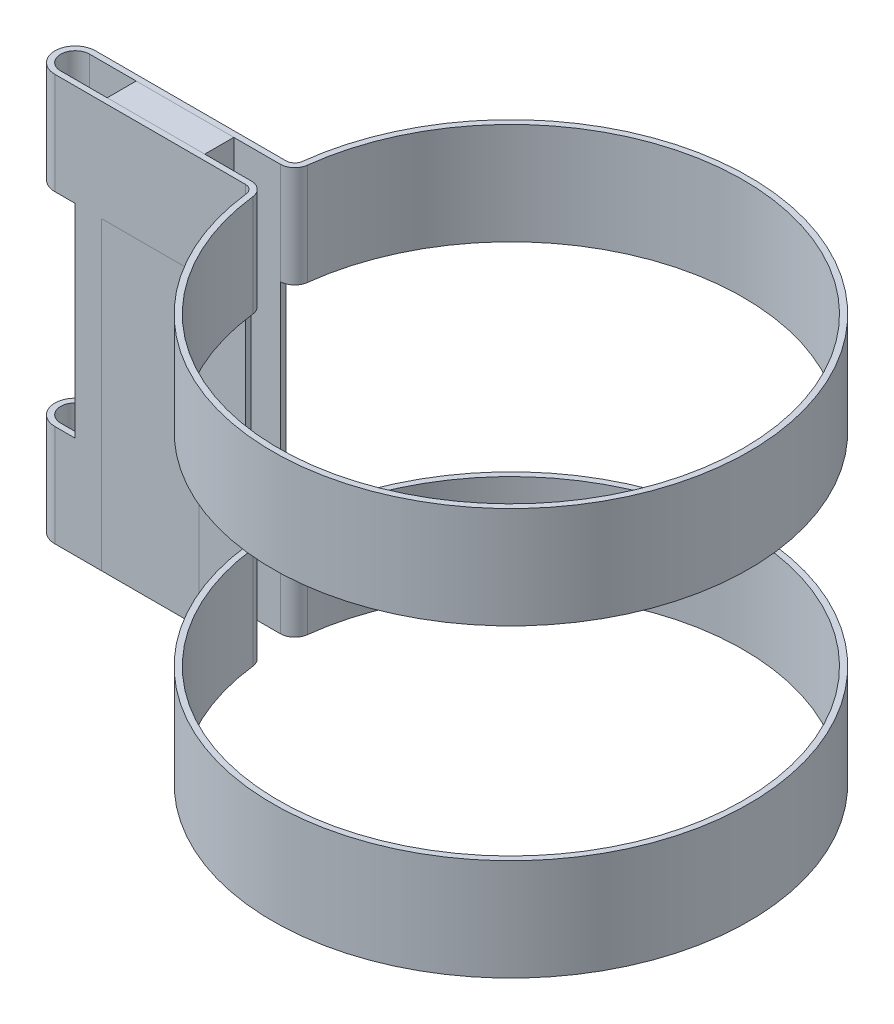
ISO-10303-21;
HEADER;
FILE_DESCRIPTION(('STEP AP214'),'2;1');
FILE_NAME('part.step','',(''),(''),'','','');
FILE_SCHEMA(('AUTOMOTIVE_DESIGN { 1 0 10303 214 1 1 1 1 }'));
ENDSEC;
DATA;
#1=APPLICATION_CONTEXT('core data for automotive mechanical design processes');
#2=APPLICATION_PROTOCOL_DEFINITION('international standard','automotive_design',2000,#1);
#3=PRODUCT_CONTEXT('',#1,'mechanical');
#4=PRODUCT('Part','Part','',(#3));
#5=PRODUCT_RELATED_PRODUCT_CATEGORY('part','',(#4));
#6=PRODUCT_DEFINITION_FORMATION('','',#4);
#7=PRODUCT_DEFINITION_CONTEXT('part definition',#1,'design');
#8=PRODUCT_DEFINITION('design','',#6,#7);
#9=PRODUCT_DEFINITION_SHAPE('','',#8);
#10=(LENGTH_UNIT() NAMED_UNIT(*) SI_UNIT(.MILLI.,.METRE.));
#11=(NAMED_UNIT(*) PLANE_ANGLE_UNIT() SI_UNIT($,.RADIAN.));
#12=(NAMED_UNIT(*) SI_UNIT($,.STERADIAN.) SOLID_ANGLE_UNIT());
#13=UNCERTAINTY_MEASURE_WITH_UNIT(LENGTH_MEASURE(1.E-05),#10,'distance_accuracy_value','');
#14=(GEOMETRIC_REPRESENTATION_CONTEXT(3) GLOBAL_UNCERTAINTY_ASSIGNED_CONTEXT((#13)) GLOBAL_UNIT_ASSIGNED_CONTEXT((#10,
#11,#12)) REPRESENTATION_CONTEXT('',''));
#15=CARTESIAN_POINT('',(0.,0.,0.));
#16=DIRECTION('',(0.,0.,1.));
#17=DIRECTION('',(1.,0.,0.));
#18=AXIS2_PLACEMENT_3D('',#15,#16,#17);
#19=CARTESIAN_POINT('',(-67.,0.,-3.49999999999998));
#20=DIRECTION('',(-1.,0.,0.));
#21=DIRECTION('',(0.,0.,1.));
#22=AXIS2_PLACEMENT_3D('',#19,#20,#21);
#23=PLANE('',#22);
#24=DIRECTION('',(0.,0.,1.));
#25=VECTOR('',#24,1.);
#26=CARTESIAN_POINT('',(-67.,70.,-3.49999999999998));
#27=LINE('',#26,#25);
#28=CARTESIAN_POINT('',(-67.,70.,-3.49999999999998));
#29=VERTEX_POINT('',#28);
#30=CARTESIAN_POINT('',(-67.,70.,3.5));
#31=VERTEX_POINT('',#30);
#32=EDGE_CURVE('E115',#29,#31,#27,.T.);
#33=ORIENTED_EDGE('',*,*,#32,.F.);
#34=DIRECTION('',(0.,1.,0.));
#35=VECTOR('',#34,1.);
#36=CARTESIAN_POINT('',(-67.,0.,-3.49999999999998));
#37=LINE('',#36,#35);
#38=CARTESIAN_POINT('',(-67.,0.,-3.49999999999998));
#39=VERTEX_POINT('',#38);
#40=EDGE_CURVE('E12',#39,#29,#37,.T.);
#41=ORIENTED_EDGE('',*,*,#40,.F.);
#42=DIRECTION('',(0.,0.,1.));
#43=VECTOR('',#42,1.);
#44=CARTESIAN_POINT('',(-67.,0.,-3.49999999999998));
#45=LINE('',#44,#43);
#46=CARTESIAN_POINT('',(-67.,0.,3.5));
#47=VERTEX_POINT('',#46);
#48=EDGE_CURVE('E109',#39,#47,#45,.T.);
#49=ORIENTED_EDGE('',*,*,#48,.T.);
#50=DIRECTION('',(0.,1.,0.));
#51=VECTOR('',#50,1.);
#52=CARTESIAN_POINT('',(-67.,0.,3.5));
#53=LINE('',#52,#51);
#54=EDGE_CURVE('E54',#47,#31,#53,.T.);
#55=ORIENTED_EDGE('',*,*,#54,.T.);
#56=EDGE_LOOP('',(#33,#41,#49,#55));
#57=FACE_BOUND('',#56,.T.);
#58=ADVANCED_FACE('F51',(#57),#23,.T.);
#59=CARTESIAN_POINT('',(-67.,0.,-3.49999999999998));
#60=DIRECTION('',(0.,0.,-1.));
#61=DIRECTION('',(-1.,0.,0.));
#62=AXIS2_PLACEMENT_3D('',#59,#60,#61);
#63=PLANE('',#62);
#64=DIRECTION('',(-1.,0.,0.));
#65=VECTOR('',#64,1.);
#66=CARTESIAN_POINT('',(-67.,70.,-3.49999999999998));
#67=LINE('',#66,#65);
#68=CARTESIAN_POINT('',(-50.2048575403353,70.,-3.49999999999998));
#69=VERTEX_POINT('',#68);
#70=EDGE_CURVE('E111',#69,#29,#67,.T.);
#71=ORIENTED_EDGE('',*,*,#70,.F.);
#72=DIRECTION('',(0.,1.,0.));
#73=VECTOR('',#72,1.);
#74=CARTESIAN_POINT('',(-50.2048575403353,0.,-3.49999999999998));
#75=LINE('',#74,#73);
#76=CARTESIAN_POINT('',(-50.2048575403353,0.,-3.49999999999998));
#77=VERTEX_POINT('',#76);
#78=EDGE_CURVE('E60',#77,#69,#75,.T.);
#79=ORIENTED_EDGE('',*,*,#78,.F.);
#80=DIRECTION('',(-1.,0.,0.));
#81=VECTOR('',#80,1.);
#82=CARTESIAN_POINT('',(-67.,0.,-3.49999999999998));
#83=LINE('',#82,#81);
#84=EDGE_CURVE('E106',#77,#39,#83,.T.);
#85=ORIENTED_EDGE('',*,*,#84,.T.);
#86=ORIENTED_EDGE('',*,*,#40,.T.);
#87=EDGE_LOOP('',(#71,#79,#85,#86));
#88=FACE_BOUND('',#87,.T.);
#89=ADVANCED_FACE('F125',(#88),#63,.T.);
#90=CARTESIAN_POINT('',(-50.2048575403353,0.,-3.49999999999998));
#91=DIRECTION('',(1.,0.,0.));
#92=DIRECTION('',(0.,0.,-1.));
#93=AXIS2_PLACEMENT_3D('',#90,#91,#92);
#94=PLANE('',#93);
#95=DIRECTION('',(0.,0.,-1.));
#96=VECTOR('',#95,1.);
#97=CARTESIAN_POINT('',(-50.2048575403353,70.,-3.49999999999998));
#98=LINE('',#97,#96);
#99=CARTESIAN_POINT('',(-50.2048575403353,70.,3.5));
#100=VERTEX_POINT('',#99);
#101=EDGE_CURVE('E101',#100,#69,#98,.T.);
#102=ORIENTED_EDGE('',*,*,#101,.F.);
#103=DIRECTION('',(0.,1.,0.));
#104=VECTOR('',#103,1.);
#105=CARTESIAN_POINT('',(-50.2048575403353,0.,3.5));
#106=LINE('',#105,#104);
#107=CARTESIAN_POINT('',(-50.2048575403353,0.,3.5));
#108=VERTEX_POINT('',#107);
#109=EDGE_CURVE('E96',#108,#100,#106,.T.);
#110=ORIENTED_EDGE('',*,*,#109,.F.);
#111=DIRECTION('',(0.,0.,-1.));
#112=VECTOR('',#111,1.);
#113=CARTESIAN_POINT('',(-50.2048575403353,0.,-3.49999999999998));
#114=LINE('',#113,#112);
#115=EDGE_CURVE('E99',#108,#77,#114,.T.);
#116=ORIENTED_EDGE('',*,*,#115,.T.);
#117=ORIENTED_EDGE('',*,*,#78,.T.);
#118=EDGE_LOOP('',(#102,#110,#116,#117));
#119=FACE_BOUND('',#118,.T.);
#120=ADVANCED_FACE('F98',(#119),#94,.T.);
#121=CARTESIAN_POINT('',(-67.,0.,3.5));
#122=DIRECTION('',(0.,0.,1.));
#123=DIRECTION('',(1.,0.,0.));
#124=AXIS2_PLACEMENT_3D('',#121,#122,#123);
#125=PLANE('',#124);
#126=DIRECTION('',(1.,0.,0.));
#127=VECTOR('',#126,1.);
#128=CARTESIAN_POINT('',(-67.,70.,3.5));
#129=LINE('',#128,#127);
#130=EDGE_CURVE('E118',#31,#100,#129,.T.);
#131=ORIENTED_EDGE('',*,*,#130,.F.);
#132=ORIENTED_EDGE('',*,*,#54,.F.);
#133=DIRECTION('',(1.,0.,0.));
#134=VECTOR('',#133,1.);
#135=CARTESIAN_POINT('',(-67.,0.,3.5));
#136=LINE('',#135,#134);
#137=EDGE_CURVE('E105',#47,#108,#136,.T.);
#138=ORIENTED_EDGE('',*,*,#137,.T.);
#139=ORIENTED_EDGE('',*,*,#109,.T.);
#140=EDGE_LOOP('',(#131,#132,#138,#139));
#141=FACE_BOUND('',#140,.T.);
#142=ADVANCED_FACE('F108',(#141),#125,.T.);
#143=CARTESIAN_POINT('',(0.,0.,0.));
#144=DIRECTION('',(0.,1.,0.));
#145=DIRECTION('',(0.,0.,1.));
#146=AXIS2_PLACEMENT_3D('',#143,#144,#145);
#147=PLANE('',#146);
#148=ORIENTED_EDGE('',*,*,#48,.F.);
#149=ORIENTED_EDGE('',*,*,#84,.F.);
#150=ORIENTED_EDGE('',*,*,#115,.F.);
#151=ORIENTED_EDGE('',*,*,#137,.F.);
#152=EDGE_LOOP('',(#148,#149,#150,#151));
#153=FACE_BOUND('',#152,.T.);
#154=ADVANCED_FACE('F104',(#153),#147,.F.);
#155=CARTESIAN_POINT('',(0.,70.,0.));
#156=DIRECTION('',(0.,1.,0.));
#157=DIRECTION('',(0.,0.,1.));
#158=AXIS2_PLACEMENT_3D('',#155,#156,#157);
#159=PLANE('',#158);
#160=ORIENTED_EDGE('',*,*,#32,.T.);
#161=ORIENTED_EDGE('',*,*,#130,.T.);
#162=ORIENTED_EDGE('',*,*,#101,.T.);
#163=ORIENTED_EDGE('',*,*,#70,.T.);
#164=EDGE_LOOP('',(#160,#161,#162,#163));
#165=FACE_BOUND('',#164,.T.);
#166=ADVANCED_FACE('F124',(#165),#159,.T.);
#167=CLOSED_SHELL('',(#58,#89,#120,#142,#154,#166));
#168=MANIFOLD_SOLID_BREP('B2',#167);
#169=CARTESIAN_POINT('',(-42.2048575403353,70.,4.99999999999998));
#170=DIRECTION('',(0.,-1.,0.));
#171=DIRECTION('',(0.,0.,-1.));
#172=AXIS2_PLACEMENT_3D('',#169,#170,#171);
#173=CYLINDRICAL_SURFACE('',#172,1.5);
#174=DIRECTION('',(0.,-1.,0.));
#175=VECTOR('',#174,1.);
#176=CARTESIAN_POINT('',(-40.7152743330294,70.,4.82352941176466));
#177=LINE('',#176,#175);
#178=CARTESIAN_POINT('',(-40.7152743330294,17.5,4.82352941176466));
#179=VERTEX_POINT('',#178);
#180=CARTESIAN_POINT('',(-40.7152743330294,0.,4.82352941176466));
#181=VERTEX_POINT('',#180);
#182=EDGE_CURVE('E446',#179,#181,#177,.T.);
#183=ORIENTED_EDGE('',*,*,#182,.F.);
#184=CARTESIAN_POINT('',(-42.2048575403353,17.5,4.99999999999998));
#185=DIRECTION('',(0.,-1.,0.));
#186=DIRECTION('',(1.,0.,0.));
#187=AXIS2_PLACEMENT_3D('',#184,#185,#186);
#188=CIRCLE('',#187,1.5);
#189=CARTESIAN_POINT('',(-42.2048575403353,17.5,3.49999999999998));
#190=VERTEX_POINT('',#189);
#191=EDGE_CURVE('E556',#179,#190,#188,.F.);
#192=ORIENTED_EDGE('',*,*,#191,.T.);
#193=DIRECTION('',(0.,-1.,0.));
#194=VECTOR('',#193,1.);
#195=CARTESIAN_POINT('',(-42.2048575403353,70.,3.49999999999998));
#196=LINE('',#195,#194);
#197=CARTESIAN_POINT('',(-42.2048575403353,0.,3.49999999999998));
#198=VERTEX_POINT('',#197);
#199=EDGE_CURVE('E450',#190,#198,#196,.T.);
#200=ORIENTED_EDGE('',*,*,#199,.T.);
#201=CARTESIAN_POINT('',(-42.2048575403353,0.,4.99999999999998));
#202=DIRECTION('',(0.,-1.,0.));
#203=DIRECTION('',(0.,0.,1.));
#204=AXIS2_PLACEMENT_3D('',#201,#202,#203);
#205=CIRCLE('',#204,1.5);
#206=EDGE_CURVE('E424',#198,#181,#205,.T.);
#207=ORIENTED_EDGE('',*,*,#206,.T.);
#208=EDGE_LOOP('',(#183,#192,#200,#207));
#209=FACE_BOUND('',#208,.T.);
#210=ADVANCED_FACE('F175',(#209),#173,.F.);
#211=CARTESIAN_POINT('',(0.,70.,0.));
#212=DIRECTION('',(0.,-1.,0.));
#213=DIRECTION('',(0.,0.,-1.));
#214=AXIS2_PLACEMENT_3D('',#211,#212,#213);
#215=CYLINDRICAL_SURFACE('',#214,41.);
#216=CARTESIAN_POINT('',(0.,52.5,0.));
#217=DIRECTION('',(0.,1.,0.));
#218=DIRECTION('',(0.,0.,1.));
#219=AXIS2_PLACEMENT_3D('',#216,#217,#218);
#220=CIRCLE('',#219,41.);
#221=CARTESIAN_POINT('',(-40.7152743330294,52.5,4.82352941176466));
#222=VERTEX_POINT('',#221);
#223=CARTESIAN_POINT('',(-40.7152743330294,52.5,-4.82352941176471));
#224=VERTEX_POINT('',#223);
#225=EDGE_CURVE('E548',#222,#224,#220,.T.);
#226=ORIENTED_EDGE('',*,*,#225,.T.);
#227=DIRECTION('',(0.,-1.,0.));
#228=VECTOR('',#227,1.);
#229=CARTESIAN_POINT('',(-40.7152743330294,70.,-4.82352941176471));
#230=LINE('',#229,#228);
#231=CARTESIAN_POINT('',(-40.7152743330294,70.,-4.82352941176471));
#232=VERTEX_POINT('',#231);
#233=EDGE_CURVE('E443',#232,#224,#230,.T.);
#234=ORIENTED_EDGE('',*,*,#233,.F.);
#235=CARTESIAN_POINT('',(0.,70.,0.));
#236=DIRECTION('',(0.,1.,0.));
#237=DIRECTION('',(0.,0.,1.));
#238=AXIS2_PLACEMENT_3D('',#235,#236,#237);
#239=CIRCLE('',#238,41.);
#240=CARTESIAN_POINT('',(-40.7152743330294,70.,4.82352941176466));
#241=VERTEX_POINT('',#240);
#242=EDGE_CURVE('E412',#241,#232,#239,.T.);
#243=ORIENTED_EDGE('',*,*,#242,.F.);
#244=EDGE_CURVE('E447',#241,#222,#177,.T.);
#245=ORIENTED_EDGE('',*,*,#244,.T.);
#246=EDGE_LOOP('',(#226,#234,#243,#245));
#247=FACE_BOUND('',#246,.T.);
#248=ADVANCED_FACE('F622',(#247),#215,.T.);
#249=CARTESIAN_POINT('',(-42.2048575403353,70.,-5.));
#250=DIRECTION('',(0.,-1.,0.));
#251=DIRECTION('',(0.,0.,-1.));
#252=AXIS2_PLACEMENT_3D('',#249,#250,#251);
#253=CYLINDRICAL_SURFACE('',#252,1.50000000000001);
#254=DIRECTION('',(0.,-1.,0.));
#255=VECTOR('',#254,1.);
#256=CARTESIAN_POINT('',(-42.2048575403353,70.,-3.49999999999998));
#257=LINE('',#256,#255);
#258=CARTESIAN_POINT('',(-42.2048575403353,17.5,-3.49999999999998));
#259=VERTEX_POINT('',#258);
#260=CARTESIAN_POINT('',(-42.2048575403353,0.,-3.49999999999998));
#261=VERTEX_POINT('',#260);
#262=EDGE_CURVE('E438',#259,#261,#257,.T.);
#263=ORIENTED_EDGE('',*,*,#262,.F.);
#264=CARTESIAN_POINT('',(-42.2048575403353,17.5,-5.));
#265=DIRECTION('',(0.,-1.,0.));
#266=DIRECTION('',(1.,0.,0.));
#267=AXIS2_PLACEMENT_3D('',#264,#265,#266);
#268=CIRCLE('',#267,1.50000000000001);
#269=CARTESIAN_POINT('',(-40.7152743330294,17.5,-4.82352941176471));
#270=VERTEX_POINT('',#269);
#271=EDGE_CURVE('E373',#259,#270,#268,.F.);
#272=ORIENTED_EDGE('',*,*,#271,.T.);
#273=CARTESIAN_POINT('',(-40.7152743330294,0.,-4.82352941176471));
#274=VERTEX_POINT('',#273);
#275=EDGE_CURVE('E442',#270,#274,#230,.T.);
#276=ORIENTED_EDGE('',*,*,#275,.T.);
#277=CARTESIAN_POINT('',(-42.2048575403353,0.,-5.));
#278=DIRECTION('',(0.,-1.,0.));
#279=DIRECTION('',(0.,0.,1.));
#280=AXIS2_PLACEMENT_3D('',#277,#278,#279);
#281=CIRCLE('',#280,1.50000000000001);
#282=EDGE_CURVE('E430',#274,#261,#281,.T.);
#283=ORIENTED_EDGE('',*,*,#282,.T.);
#284=EDGE_LOOP('',(#263,#272,#276,#283));
#285=FACE_BOUND('',#284,.T.);
#286=ADVANCED_FACE('F656',(#285),#253,.F.);
#287=CARTESIAN_POINT('',(-42.2048575403353,70.,4.99999999999998));
#288=DIRECTION('',(0.,-1.,0.));
#289=DIRECTION('',(0.,0.,-1.));
#290=AXIS2_PLACEMENT_3D('',#287,#288,#289);
#291=CYLINDRICAL_SURFACE('',#290,2.49999999999999);
#292=CARTESIAN_POINT('',(-42.2048575403353,17.5,4.99999999999998));
#293=DIRECTION('',(0.,-1.,0.));
#294=DIRECTION('',(1.,0.,0.));
#295=AXIS2_PLACEMENT_3D('',#292,#293,#294);
#296=CIRCLE('',#295,2.49999999999999);
#297=CARTESIAN_POINT('',(-39.7222188614921,17.5,4.70588235294116));
#298=VERTEX_POINT('',#297);
#299=CARTESIAN_POINT('',(-42.2048575403353,17.5,2.5));
#300=VERTEX_POINT('',#299);
#301=EDGE_CURVE('E543',#298,#300,#296,.F.);
#302=ORIENTED_EDGE('',*,*,#301,.F.);
#303=DIRECTION('',(0.,-1.,0.));
#304=VECTOR('',#303,1.);
#305=CARTESIAN_POINT('',(-39.7222188614921,70.,4.70588235294116));
#306=LINE('',#305,#304);
#307=CARTESIAN_POINT('',(-39.7222188614921,0.,4.70588235294116));
#308=VERTEX_POINT('',#307);
#309=EDGE_CURVE('E399',#298,#308,#306,.T.);
#310=ORIENTED_EDGE('',*,*,#309,.T.);
#311=CARTESIAN_POINT('',(-42.2048575403353,0.,4.99999999999998));
#312=DIRECTION('',(0.,-1.,0.));
#313=DIRECTION('',(0.,0.,1.));
#314=AXIS2_PLACEMENT_3D('',#311,#312,#313);
#315=CIRCLE('',#314,2.49999999999999);
#316=CARTESIAN_POINT('',(-42.2048575403353,0.,2.5));
#317=VERTEX_POINT('',#316);
#318=EDGE_CURVE('E498',#317,#308,#315,.T.);
#319=ORIENTED_EDGE('',*,*,#318,.F.);
#320=DIRECTION('',(0.,-1.,0.));
#321=VECTOR('',#320,1.);
#322=CARTESIAN_POINT('',(-42.2048575403353,70.,2.5));
#323=LINE('',#322,#321);
#324=EDGE_CURVE('E497',#300,#317,#323,.T.);
#325=ORIENTED_EDGE('',*,*,#324,.F.);
#326=EDGE_LOOP('',(#302,#310,#319,#325));
#327=FACE_BOUND('',#326,.T.);
#328=ADVANCED_FACE('F779',(#327),#291,.T.);
#329=CARTESIAN_POINT('',(0.,70.,0.));
#330=DIRECTION('',(0.,-1.,0.));
#331=DIRECTION('',(0.,0.,-1.));
#332=AXIS2_PLACEMENT_3D('',#329,#330,#331);
#333=CYLINDRICAL_SURFACE('',#332,40.);
#334=CARTESIAN_POINT('',(0.,17.5,0.));
#335=DIRECTION('',(0.,-1.,0.));
#336=DIRECTION('',(1.,0.,0.));
#337=AXIS2_PLACEMENT_3D('',#334,#335,#336);
#338=CIRCLE('',#337,40.);
#339=CARTESIAN_POINT('',(-39.7222188614921,17.5,-4.70588235294118));
#340=VERTEX_POINT('',#339);
#341=EDGE_CURVE('E541',#340,#298,#338,.T.);
#342=ORIENTED_EDGE('',*,*,#341,.F.);
#343=DIRECTION('',(0.,-1.,0.));
#344=VECTOR('',#343,1.);
#345=CARTESIAN_POINT('',(-39.7222188614921,70.,-4.70588235294118));
#346=LINE('',#345,#344);
#347=CARTESIAN_POINT('',(-39.7222188614921,0.,-4.70588235294118));
#348=VERTEX_POINT('',#347);
#349=EDGE_CURVE('E382',#340,#348,#346,.T.);
#350=ORIENTED_EDGE('',*,*,#349,.T.);
#351=CARTESIAN_POINT('',(0.,0.,0.));
#352=DIRECTION('',(0.,1.,0.));
#353=DIRECTION('',(0.,0.,1.));
#354=AXIS2_PLACEMENT_3D('',#351,#352,#353);
#355=CIRCLE('',#354,40.);
#356=EDGE_CURVE('E501',#308,#348,#355,.T.);
#357=ORIENTED_EDGE('',*,*,#356,.F.);
#358=ORIENTED_EDGE('',*,*,#309,.F.);
#359=EDGE_LOOP('',(#342,#350,#357,#358));
#360=FACE_BOUND('',#359,.T.);
#361=ADVANCED_FACE('F540',(#360),#333,.F.);
#362=CARTESIAN_POINT('',(-42.2048575403353,70.,-5.));
#363=DIRECTION('',(0.,-1.,0.));
#364=DIRECTION('',(0.,0.,-1.));
#365=AXIS2_PLACEMENT_3D('',#362,#363,#364);
#366=CYLINDRICAL_SURFACE('',#365,2.5);
#367=CARTESIAN_POINT('',(-42.2048575403353,17.5,-5.));
#368=DIRECTION('',(0.,-1.,0.));
#369=DIRECTION('',(1.,0.,0.));
#370=AXIS2_PLACEMENT_3D('',#367,#368,#369);
#371=CIRCLE('',#370,2.5);
#372=CARTESIAN_POINT('',(-42.2048575403353,17.5,-2.5));
#373=VERTEX_POINT('',#372);
#374=EDGE_CURVE('E49',#373,#340,#371,.F.);
#375=ORIENTED_EDGE('',*,*,#374,.F.);
#376=DIRECTION('',(0.,-1.,0.));
#377=VECTOR('',#376,1.);
#378=CARTESIAN_POINT('',(-42.2048575403353,70.,-2.5));
#379=LINE('',#378,#377);
#380=CARTESIAN_POINT('',(-42.2048575403353,0.,-2.5));
#381=VERTEX_POINT('',#380);
#382=EDGE_CURVE('E380',#373,#381,#379,.T.);
#383=ORIENTED_EDGE('',*,*,#382,.T.);
#384=CARTESIAN_POINT('',(-42.2048575403353,0.,-5.));
#385=DIRECTION('',(0.,-1.,0.));
#386=DIRECTION('',(0.,0.,1.));
#387=AXIS2_PLACEMENT_3D('',#384,#385,#386);
#388=CIRCLE('',#387,2.5);
#389=EDGE_CURVE('E505',#348,#381,#388,.T.);
#390=ORIENTED_EDGE('',*,*,#389,.F.);
#391=ORIENTED_EDGE('',*,*,#349,.F.);
#392=EDGE_LOOP('',(#375,#383,#390,#391));
#393=FACE_BOUND('',#392,.T.);
#394=ADVANCED_FACE('F378',(#393),#366,.T.);
#395=CARTESIAN_POINT('',(-75.,70.,0.));
#396=DIRECTION('',(0.,-1.,0.));
#397=DIRECTION('',(0.,0.,-1.));
#398=AXIS2_PLACEMENT_3D('',#395,#396,#397);
#399=CYLINDRICAL_SURFACE('',#398,3.49999999999999);
#400=DIRECTION('',(0.,-1.,0.));
#401=VECTOR('',#400,1.);
#402=CARTESIAN_POINT('',(-75.,70.,3.5));
#403=LINE('',#402,#401);
#404=CARTESIAN_POINT('',(-75.,17.5,3.49999999999998));
#405=VERTEX_POINT('',#404);
#406=CARTESIAN_POINT('',(-75.,0.,3.5));
#407=VERTEX_POINT('',#406);
#408=EDGE_CURVE('E454',#405,#407,#403,.T.);
#409=ORIENTED_EDGE('',*,*,#408,.F.);
#410=CARTESIAN_POINT('',(-75.,17.5,0.));
#411=DIRECTION('',(0.,-1.,0.));
#412=DIRECTION('',(0.,0.,-1.));
#413=AXIS2_PLACEMENT_3D('',#410,#411,#412);
#414=CIRCLE('',#413,3.49999999999999);
#415=CARTESIAN_POINT('',(-75.,17.5,-3.49999999999998));
#416=VERTEX_POINT('',#415);
#417=EDGE_CURVE('E591',#405,#416,#414,.T.);
#418=ORIENTED_EDGE('',*,*,#417,.T.);
#419=DIRECTION('',(0.,-1.,0.));
#420=VECTOR('',#419,1.);
#421=CARTESIAN_POINT('',(-75.,70.,-3.49999999999998));
#422=LINE('',#421,#420);
#423=CARTESIAN_POINT('',(-75.,0.,-3.49999999999998));
#424=VERTEX_POINT('',#423);
#425=EDGE_CURVE('E418',#416,#424,#422,.T.);
#426=ORIENTED_EDGE('',*,*,#425,.T.);
#427=CARTESIAN_POINT('',(-75.,0.,0.));
#428=DIRECTION('',(0.,1.,0.));
#429=DIRECTION('',(0.,0.,1.));
#430=AXIS2_PLACEMENT_3D('',#427,#428,#429);
#431=CIRCLE('',#430,3.49999999999999);
#432=EDGE_CURVE('E403',#424,#407,#431,.T.);
#433=ORIENTED_EDGE('',*,*,#432,.T.);
#434=EDGE_LOOP('',(#409,#418,#426,#433));
#435=FACE_BOUND('',#434,.T.);
#436=ADVANCED_FACE('F677',(#435),#399,.T.);
#437=CARTESIAN_POINT('',(-75.,70.,0.));
#438=DIRECTION('',(0.,-1.,0.));
#439=DIRECTION('',(0.,0.,-1.));
#440=AXIS2_PLACEMENT_3D('',#437,#438,#439);
#441=CYLINDRICAL_SURFACE('',#440,2.49999999999999);
#442=CARTESIAN_POINT('',(-75.,17.5,0.));
#443=DIRECTION('',(0.,-1.,0.));
#444=DIRECTION('',(0.,0.,-1.));
#445=AXIS2_PLACEMENT_3D('',#442,#443,#444);
#446=CIRCLE('',#445,2.49999999999999);
#447=CARTESIAN_POINT('',(-75.,17.5,2.5));
#448=VERTEX_POINT('',#447);
#449=CARTESIAN_POINT('',(-75.,17.5,-2.49999999999998));
#450=VERTEX_POINT('',#449);
#451=EDGE_CURVE('E528',#448,#450,#446,.T.);
#452=ORIENTED_EDGE('',*,*,#451,.F.);
#453=DIRECTION('',(0.,-1.,0.));
#454=VECTOR('',#453,1.);
#455=CARTESIAN_POINT('',(-75.,70.,2.5));
#456=LINE('',#455,#454);
#457=CARTESIAN_POINT('',(-75.,0.,2.5));
#458=VERTEX_POINT('',#457);
#459=EDGE_CURVE('E515',#448,#458,#456,.T.);
#460=ORIENTED_EDGE('',*,*,#459,.T.);
#461=CARTESIAN_POINT('',(-75.,0.,0.));
#462=DIRECTION('',(0.,1.,0.));
#463=DIRECTION('',(0.,0.,1.));
#464=AXIS2_PLACEMENT_3D('',#461,#462,#463);
#465=CIRCLE('',#464,2.49999999999999);
#466=CARTESIAN_POINT('',(-75.,0.,-2.49999999999998));
#467=VERTEX_POINT('',#466);
#468=EDGE_CURVE('E508',#467,#458,#465,.T.);
#469=ORIENTED_EDGE('',*,*,#468,.F.);
#470=DIRECTION('',(0.,-1.,0.));
#471=VECTOR('',#470,1.);
#472=CARTESIAN_POINT('',(-75.,70.,-2.49999999999998));
#473=LINE('',#472,#471);
#474=EDGE_CURVE('E392',#450,#467,#473,.T.);
#475=ORIENTED_EDGE('',*,*,#474,.F.);
#476=EDGE_LOOP('',(#452,#460,#469,#475));
#477=FACE_BOUND('',#476,.T.);
#478=ADVANCED_FACE('F526',(#477),#441,.F.);
#479=CARTESIAN_POINT('',(-75.,70.,0.));
#480=DIRECTION('',(0.,1.,0.));
#481=DIRECTION('',(0.,0.,1.));
#482=AXIS2_PLACEMENT_3D('',#479,#480,#481);
#483=PLANE('',#482);
#484=CARTESIAN_POINT('',(-75.,70.,0.));
#485=DIRECTION('',(0.,1.,0.));
#486=DIRECTION('',(0.,0.,1.));
#487=AXIS2_PLACEMENT_3D('',#484,#485,#486);
#488=CIRCLE('',#487,3.49999999999999);
#489=CARTESIAN_POINT('',(-75.,70.,-3.49999999999998));
#490=VERTEX_POINT('',#489);
#491=CARTESIAN_POINT('',(-75.,70.,3.5));
#492=VERTEX_POINT('',#491);
#493=EDGE_CURVE('E404',#490,#492,#488,.T.);
#494=ORIENTED_EDGE('',*,*,#493,.T.);
#495=DIRECTION('',(1.,0.,0.));
#496=VECTOR('',#495,1.);
#497=CARTESIAN_POINT('',(-75.,70.,3.5));
#498=LINE('',#497,#496);
#499=CARTESIAN_POINT('',(-42.2048575403353,70.,3.49999999999998));
#500=VERTEX_POINT('',#499);
#501=EDGE_CURVE('E407',#492,#500,#498,.T.);
#502=ORIENTED_EDGE('',*,*,#501,.T.);
#503=CARTESIAN_POINT('',(-42.2048575403353,70.,4.99999999999998));
#504=DIRECTION('',(0.,-1.,0.));
#505=DIRECTION('',(0.,0.,1.));
#506=AXIS2_PLACEMENT_3D('',#503,#504,#505);
#507=CIRCLE('',#506,1.5);
#508=EDGE_CURVE('E410',#500,#241,#507,.T.);
#509=ORIENTED_EDGE('',*,*,#508,.T.);
#510=ORIENTED_EDGE('',*,*,#242,.T.);
#511=CARTESIAN_POINT('',(-42.2048575403353,70.,-5.));
#512=DIRECTION('',(0.,-1.,0.));
#513=DIRECTION('',(0.,0.,1.));
#514=AXIS2_PLACEMENT_3D('',#511,#512,#513);
#515=CIRCLE('',#514,1.50000000000001);
#516=CARTESIAN_POINT('',(-42.2048575403353,70.,-3.49999999999998));
#517=VERTEX_POINT('',#516);
#518=EDGE_CURVE('E414',#232,#517,#515,.T.);
#519=ORIENTED_EDGE('',*,*,#518,.T.);
#520=DIRECTION('',(-1.,0.,0.));
#521=VECTOR('',#520,1.);
#522=CARTESIAN_POINT('',(-75.,70.,-3.49999999999998));
#523=LINE('',#522,#521);
#524=EDGE_CURVE('E416',#517,#490,#523,.T.);
#525=ORIENTED_EDGE('',*,*,#524,.T.);
#526=EDGE_LOOP('',(#494,#502,#509,#510,#519,#525));
#527=FACE_BOUND('',#526,.T.);
#528=CARTESIAN_POINT('',(0.,70.,0.));
#529=DIRECTION('',(0.,1.,0.));
#530=DIRECTION('',(0.,0.,1.));
#531=AXIS2_PLACEMENT_3D('',#528,#529,#530);
#532=CIRCLE('',#531,40.);
#533=CARTESIAN_POINT('',(-39.7222188614921,70.,4.70588235294116));
#534=VERTEX_POINT('',#533);
#535=CARTESIAN_POINT('',(-39.7222188614921,70.,-4.70588235294118));
#536=VERTEX_POINT('',#535);
#537=EDGE_CURVE('E479',#534,#536,#532,.T.);
#538=ORIENTED_EDGE('',*,*,#537,.F.);
#539=CARTESIAN_POINT('',(-42.2048575403353,70.,4.99999999999998));
#540=DIRECTION('',(0.,-1.,0.));
#541=DIRECTION('',(0.,0.,1.));
#542=AXIS2_PLACEMENT_3D('',#539,#540,#541);
#543=CIRCLE('',#542,2.49999999999999);
#544=CARTESIAN_POINT('',(-42.2048575403353,70.,2.5));
#545=VERTEX_POINT('',#544);
#546=EDGE_CURVE('E483',#545,#534,#543,.T.);
#547=ORIENTED_EDGE('',*,*,#546,.F.);
#548=DIRECTION('',(1.,0.,0.));
#549=VECTOR('',#548,1.);
#550=CARTESIAN_POINT('',(-75.,70.,2.5));
#551=LINE('',#550,#549);
#552=CARTESIAN_POINT('',(-75.,70.,2.5));
#553=VERTEX_POINT('',#552);
#554=EDGE_CURVE('E495',#553,#545,#551,.T.);
#555=ORIENTED_EDGE('',*,*,#554,.F.);
#556=CARTESIAN_POINT('',(-75.,70.,0.));
#557=DIRECTION('',(0.,1.,0.));
#558=DIRECTION('',(0.,0.,1.));
#559=AXIS2_PLACEMENT_3D('',#556,#557,#558);
#560=CIRCLE('',#559,2.49999999999999);
#561=CARTESIAN_POINT('',(-75.,70.,-2.49999999999998));
#562=VERTEX_POINT('',#561);
#563=EDGE_CURVE('E492',#562,#553,#560,.T.);
#564=ORIENTED_EDGE('',*,*,#563,.F.);
#565=DIRECTION('',(-1.,0.,0.));
#566=VECTOR('',#565,1.);
#567=CARTESIAN_POINT('',(-75.,70.,-2.49999999999998));
#568=LINE('',#567,#566);
#569=CARTESIAN_POINT('',(-42.2048575403353,70.,-2.5));
#570=VERTEX_POINT('',#569);
#571=EDGE_CURVE('E485',#570,#562,#568,.T.);
#572=ORIENTED_EDGE('',*,*,#571,.F.);
#573=CARTESIAN_POINT('',(-42.2048575403353,70.,-5.));
#574=DIRECTION('',(0.,-1.,0.));
#575=DIRECTION('',(0.,0.,1.));
#576=AXIS2_PLACEMENT_3D('',#573,#574,#575);
#577=CIRCLE('',#576,2.5);
#578=EDGE_CURVE('E482',#536,#570,#577,.T.);
#579=ORIENTED_EDGE('',*,*,#578,.F.);
#580=EDGE_LOOP('',(#538,#547,#555,#564,#572,#579));
#581=FACE_BOUND('',#580,.T.);
#582=ADVANCED_FACE('F607',(#527,#581),#483,.T.);
#583=CARTESIAN_POINT('',(-75.,0.,0.));
#584=DIRECTION('',(0.,1.,0.));
#585=DIRECTION('',(0.,0.,1.));
#586=AXIS2_PLACEMENT_3D('',#583,#584,#585);
#587=PLANE('',#586);
#588=ORIENTED_EDGE('',*,*,#432,.F.);
#589=DIRECTION('',(-1.,0.,0.));
#590=VECTOR('',#589,1.);
#591=CARTESIAN_POINT('',(-75.,0.,-3.49999999999998));
#592=LINE('',#591,#590);
#593=EDGE_CURVE('E408',#261,#424,#592,.T.);
#594=ORIENTED_EDGE('',*,*,#593,.F.);
#595=ORIENTED_EDGE('',*,*,#282,.F.);
#596=CARTESIAN_POINT('',(0.,0.,0.));
#597=DIRECTION('',(0.,1.,0.));
#598=DIRECTION('',(0.,0.,1.));
#599=AXIS2_PLACEMENT_3D('',#596,#597,#598);
#600=CIRCLE('',#599,41.);
#601=EDGE_CURVE('E427',#181,#274,#600,.T.);
#602=ORIENTED_EDGE('',*,*,#601,.F.);
#603=ORIENTED_EDGE('',*,*,#206,.F.);
#604=DIRECTION('',(1.,0.,0.));
#605=VECTOR('',#604,1.);
#606=CARTESIAN_POINT('',(-75.,0.,3.5));
#607=LINE('',#606,#605);
#608=EDGE_CURVE('E421',#407,#198,#607,.T.);
#609=ORIENTED_EDGE('',*,*,#608,.F.);
#610=EDGE_LOOP('',(#588,#594,#595,#602,#603,#609));
#611=FACE_BOUND('',#610,.T.);
#612=ORIENTED_EDGE('',*,*,#318,.T.);
#613=ORIENTED_EDGE('',*,*,#356,.T.);
#614=ORIENTED_EDGE('',*,*,#389,.T.);
#615=DIRECTION('',(-1.,0.,0.));
#616=VECTOR('',#615,1.);
#617=CARTESIAN_POINT('',(-75.,0.,-2.49999999999998));
#618=LINE('',#617,#616);
#619=EDGE_CURVE('E386',#381,#467,#618,.T.);
#620=ORIENTED_EDGE('',*,*,#619,.T.);
#621=ORIENTED_EDGE('',*,*,#468,.T.);
#622=DIRECTION('',(1.,0.,0.));
#623=VECTOR('',#622,1.);
#624=CARTESIAN_POINT('',(-75.,0.,2.5));
#625=LINE('',#624,#623);
#626=EDGE_CURVE('E487',#458,#317,#625,.T.);
#627=ORIENTED_EDGE('',*,*,#626,.T.);
#628=EDGE_LOOP('',(#612,#613,#614,#620,#621,#627));
#629=FACE_BOUND('',#628,.T.);
#630=ADVANCED_FACE('F536',(#611,#629),#587,.F.);
#631=CARTESIAN_POINT('',(-75.,52.5,-3.49999999999998));
#632=VERTEX_POINT('',#631);
#633=EDGE_CURVE('E435',#490,#632,#422,.T.);
#634=ORIENTED_EDGE('',*,*,#633,.T.);
#635=CARTESIAN_POINT('',(-75.,52.5,0.));
#636=DIRECTION('',(0.,1.,0.));
#637=DIRECTION('',(0.,0.,1.));
#638=AXIS2_PLACEMENT_3D('',#635,#636,#637);
#639=CIRCLE('',#638,3.49999999999999);
#640=CARTESIAN_POINT('',(-75.,52.5,3.49999999999998));
#641=VERTEX_POINT('',#640);
#642=EDGE_CURVE('E586',#632,#641,#639,.T.);
#643=ORIENTED_EDGE('',*,*,#642,.T.);
#644=EDGE_CURVE('E455',#492,#641,#403,.T.);
#645=ORIENTED_EDGE('',*,*,#644,.F.);
#646=ORIENTED_EDGE('',*,*,#493,.F.);
#647=EDGE_LOOP('',(#634,#643,#645,#646));
#648=FACE_BOUND('',#647,.T.);
#649=ADVANCED_FACE('F177',(#648),#399,.T.);
#650=CARTESIAN_POINT('',(-75.,70.,3.5));
#651=DIRECTION('',(0.,0.,-1.));
#652=DIRECTION('',(-1.,0.,0.));
#653=AXIS2_PLACEMENT_3D('',#650,#651,#652);
#654=PLANE('',#653);
#655=DIRECTION('',(0.,1.,0.));
#656=VECTOR('',#655,1.);
#657=CARTESIAN_POINT('',(-71.5,52.5,3.49999999999998));
#658=LINE('',#657,#656);
#659=CARTESIAN_POINT('',(-71.5,17.5,3.49999999999998));
#660=VERTEX_POINT('',#659);
#661=CARTESIAN_POINT('',(-71.5,52.5,3.49999999999998));
#662=VERTEX_POINT('',#661);
#663=EDGE_CURVE('E559',#660,#662,#658,.T.);
#664=ORIENTED_EDGE('',*,*,#663,.F.);
#665=DIRECTION('',(1.,0.,0.));
#666=VECTOR('',#665,1.);
#667=CARTESIAN_POINT('',(-78.5,17.5,3.49999999999998));
#668=LINE('',#667,#666);
#669=EDGE_CURVE('E572',#405,#660,#668,.T.);
#670=ORIENTED_EDGE('',*,*,#669,.F.);
#671=ORIENTED_EDGE('',*,*,#408,.T.);
#672=ORIENTED_EDGE('',*,*,#608,.T.);
#673=ORIENTED_EDGE('',*,*,#199,.F.);
#674=DIRECTION('',(0.,-1.,0.));
#675=VECTOR('',#674,1.);
#676=CARTESIAN_POINT('',(-42.2048575403353,70.,3.49999999999998));
#677=LINE('',#676,#675);
#678=CARTESIAN_POINT('',(-42.2048575403353,52.5,3.49999999999998));
#679=VERTEX_POINT('',#678);
#680=EDGE_CURVE('E617',#190,#679,#677,.F.);
#681=ORIENTED_EDGE('',*,*,#680,.T.);
#682=EDGE_CURVE('E451',#500,#679,#196,.T.);
#683=ORIENTED_EDGE('',*,*,#682,.F.);
#684=ORIENTED_EDGE('',*,*,#501,.F.);
#685=ORIENTED_EDGE('',*,*,#644,.T.);
#686=DIRECTION('',(-1.,0.,0.));
#687=VECTOR('',#686,1.);
#688=CARTESIAN_POINT('',(-78.5,52.5,3.49999999999998));
#689=LINE('',#688,#687);
#690=EDGE_CURVE('E569',#662,#641,#689,.T.);
#691=ORIENTED_EDGE('',*,*,#690,.F.);
#692=EDGE_LOOP('',(#664,#670,#671,#672,#673,#681,#683,#684,#685,#691));
#693=FACE_BOUND('',#692,.T.);
#694=ADVANCED_FACE('F644',(#693),#654,.F.);
#695=ORIENTED_EDGE('',*,*,#682,.T.);
#696=CARTESIAN_POINT('',(-42.2048575403353,52.5,4.99999999999998));
#697=DIRECTION('',(0.,1.,0.));
#698=DIRECTION('',(0.,0.,1.));
#699=AXIS2_PLACEMENT_3D('',#696,#697,#698);
#700=CIRCLE('',#699,1.5);
#701=EDGE_CURVE('E544',#679,#222,#700,.F.);
#702=ORIENTED_EDGE('',*,*,#701,.T.);
#703=ORIENTED_EDGE('',*,*,#244,.F.);
#704=ORIENTED_EDGE('',*,*,#508,.F.);
#705=EDGE_LOOP('',(#695,#702,#703,#704));
#706=FACE_BOUND('',#705,.T.);
#707=ADVANCED_FACE('F635',(#706),#173,.F.);
#708=ORIENTED_EDGE('',*,*,#275,.F.);
#709=CARTESIAN_POINT('',(0.,17.5,0.));
#710=DIRECTION('',(0.,-1.,0.));
#711=DIRECTION('',(1.,0.,0.));
#712=AXIS2_PLACEMENT_3D('',#709,#710,#711);
#713=CIRCLE('',#712,41.);
#714=EDGE_CURVE('E553',#270,#179,#713,.T.);
#715=ORIENTED_EDGE('',*,*,#714,.T.);
#716=ORIENTED_EDGE('',*,*,#182,.T.);
#717=ORIENTED_EDGE('',*,*,#601,.T.);
#718=EDGE_LOOP('',(#708,#715,#716,#717));
#719=FACE_BOUND('',#718,.T.);
#720=ADVANCED_FACE('F653',(#719),#215,.T.);
#721=ORIENTED_EDGE('',*,*,#233,.T.);
#722=CARTESIAN_POINT('',(-42.2048575403353,52.5,-5.));
#723=DIRECTION('',(0.,1.,0.));
#724=DIRECTION('',(0.,0.,1.));
#725=AXIS2_PLACEMENT_3D('',#722,#723,#724);
#726=CIRCLE('',#725,1.50000000000001);
#727=CARTESIAN_POINT('',(-42.2048575403353,52.5,-3.49999999999998));
#728=VERTEX_POINT('',#727);
#729=EDGE_CURVE('E614',#224,#728,#726,.F.);
#730=ORIENTED_EDGE('',*,*,#729,.T.);
#731=EDGE_CURVE('E439',#517,#728,#257,.T.);
#732=ORIENTED_EDGE('',*,*,#731,.F.);
#733=ORIENTED_EDGE('',*,*,#518,.F.);
#734=EDGE_LOOP('',(#721,#730,#732,#733));
#735=FACE_BOUND('',#734,.T.);
#736=ADVANCED_FACE('F628',(#735),#253,.F.);
#737=CARTESIAN_POINT('',(-75.,70.,-3.49999999999998));
#738=DIRECTION('',(0.,0.,1.));
#739=DIRECTION('',(1.,0.,0.));
#740=AXIS2_PLACEMENT_3D('',#737,#738,#739);
#741=PLANE('',#740);
#742=ORIENTED_EDGE('',*,*,#425,.F.);
#743=DIRECTION('',(-1.,0.,0.));
#744=VECTOR('',#743,1.);
#745=CARTESIAN_POINT('',(-78.5,17.5,-3.49999999999998));
#746=LINE('',#745,#744);
#747=CARTESIAN_POINT('',(-71.5,17.5,-3.49999999999998));
#748=VERTEX_POINT('',#747);
#749=EDGE_CURVE('E560',#748,#416,#746,.T.);
#750=ORIENTED_EDGE('',*,*,#749,.F.);
#751=DIRECTION('',(0.,-1.,0.));
#752=VECTOR('',#751,1.);
#753=CARTESIAN_POINT('',(-71.5,52.5,-3.49999999999998));
#754=LINE('',#753,#752);
#755=CARTESIAN_POINT('',(-71.5,52.5,-3.49999999999998));
#756=VERTEX_POINT('',#755);
#757=EDGE_CURVE('E563',#756,#748,#754,.T.);
#758=ORIENTED_EDGE('',*,*,#757,.F.);
#759=DIRECTION('',(1.,0.,0.));
#760=VECTOR('',#759,1.);
#761=CARTESIAN_POINT('',(-78.5,52.5,-3.49999999999998));
#762=LINE('',#761,#760);
#763=EDGE_CURVE('E566',#632,#756,#762,.T.);
#764=ORIENTED_EDGE('',*,*,#763,.F.);
#765=ORIENTED_EDGE('',*,*,#633,.F.);
#766=ORIENTED_EDGE('',*,*,#524,.F.);
#767=ORIENTED_EDGE('',*,*,#731,.T.);
#768=DIRECTION('',(0.,-1.,0.));
#769=VECTOR('',#768,1.);
#770=CARTESIAN_POINT('',(-42.2048575403353,70.,-3.49999999999998));
#771=LINE('',#770,#769);
#772=EDGE_CURVE('E366',#728,#259,#771,.T.);
#773=ORIENTED_EDGE('',*,*,#772,.T.);
#774=ORIENTED_EDGE('',*,*,#262,.T.);
#775=ORIENTED_EDGE('',*,*,#593,.T.);
#776=EDGE_LOOP('',(#742,#750,#758,#764,#765,#766,#767,#773,#774,#775));
#777=FACE_BOUND('',#776,.T.);
#778=ADVANCED_FACE('F660',(#777),#741,.F.);
#779=CARTESIAN_POINT('',(-42.2048575403353,52.5,4.99999999999998));
#780=DIRECTION('',(0.,1.,0.));
#781=DIRECTION('',(0.,0.,1.));
#782=AXIS2_PLACEMENT_3D('',#779,#780,#781);
#783=CIRCLE('',#782,2.49999999999999);
#784=CARTESIAN_POINT('',(-42.2048575403353,52.5,2.5));
#785=VERTEX_POINT('',#784);
#786=CARTESIAN_POINT('',(-39.7222188614921,52.5,4.70588235294116));
#787=VERTEX_POINT('',#786);
#788=EDGE_CURVE('E613',#785,#787,#783,.F.);
#789=ORIENTED_EDGE('',*,*,#788,.F.);
#790=EDGE_CURVE('E513',#545,#785,#323,.T.);
#791=ORIENTED_EDGE('',*,*,#790,.F.);
#792=ORIENTED_EDGE('',*,*,#546,.T.);
#793=EDGE_CURVE('E400',#534,#787,#306,.T.);
#794=ORIENTED_EDGE('',*,*,#793,.T.);
#795=EDGE_LOOP('',(#789,#791,#792,#794));
#796=FACE_BOUND('',#795,.T.);
#797=ADVANCED_FACE('F612',(#796),#291,.T.);
#798=CARTESIAN_POINT('',(0.,52.5,0.));
#799=DIRECTION('',(0.,1.,0.));
#800=DIRECTION('',(0.,0.,1.));
#801=AXIS2_PLACEMENT_3D('',#798,#799,#800);
#802=CIRCLE('',#801,40.);
#803=CARTESIAN_POINT('',(-39.7222188614921,52.5,-4.70588235294118));
#804=VERTEX_POINT('',#803);
#805=EDGE_CURVE('E470',#787,#804,#802,.T.);
#806=ORIENTED_EDGE('',*,*,#805,.F.);
#807=ORIENTED_EDGE('',*,*,#793,.F.);
#808=ORIENTED_EDGE('',*,*,#537,.T.);
#809=EDGE_CURVE('E396',#536,#804,#346,.T.);
#810=ORIENTED_EDGE('',*,*,#809,.T.);
#811=EDGE_LOOP('',(#806,#807,#808,#810));
#812=FACE_BOUND('',#811,.T.);
#813=ADVANCED_FACE('F476',(#812),#333,.F.);
#814=CARTESIAN_POINT('',(-42.2048575403353,52.5,-5.));
#815=DIRECTION('',(0.,1.,0.));
#816=DIRECTION('',(0.,0.,1.));
#817=AXIS2_PLACEMENT_3D('',#814,#815,#816);
#818=CIRCLE('',#817,2.5);
#819=CARTESIAN_POINT('',(-42.2048575403353,52.5,-2.5));
#820=VERTEX_POINT('',#819);
#821=EDGE_CURVE('E183',#804,#820,#818,.F.);
#822=ORIENTED_EDGE('',*,*,#821,.F.);
#823=ORIENTED_EDGE('',*,*,#809,.F.);
#824=ORIENTED_EDGE('',*,*,#578,.T.);
#825=EDGE_CURVE('E388',#570,#820,#379,.T.);
#826=ORIENTED_EDGE('',*,*,#825,.T.);
#827=EDGE_LOOP('',(#822,#823,#824,#826));
#828=FACE_BOUND('',#827,.T.);
#829=ADVANCED_FACE('F473',(#828),#366,.T.);
#830=CARTESIAN_POINT('',(-75.,70.,-2.49999999999998));
#831=DIRECTION('',(0.,0.,1.));
#832=DIRECTION('',(1.,0.,0.));
#833=AXIS2_PLACEMENT_3D('',#830,#831,#832);
#834=PLANE('',#833);
#835=DIRECTION('',(1.,0.,0.));
#836=VECTOR('',#835,1.);
#837=CARTESIAN_POINT('',(-75.,17.5,-2.49999999999998));
#838=LINE('',#837,#836);
#839=CARTESIAN_POINT('',(-71.5,17.5,-2.49999999999999));
#840=VERTEX_POINT('',#839);
#841=EDGE_CURVE('E589',#450,#840,#838,.T.);
#842=ORIENTED_EDGE('',*,*,#841,.F.);
#843=ORIENTED_EDGE('',*,*,#474,.T.);
#844=ORIENTED_EDGE('',*,*,#619,.F.);
#845=ORIENTED_EDGE('',*,*,#382,.F.);
#846=DIRECTION('',(0.,-1.,0.));
#847=VECTOR('',#846,1.);
#848=CARTESIAN_POINT('',(-42.2048575403353,70.,-2.5));
#849=LINE('',#848,#847);
#850=EDGE_CURVE('E358',#820,#373,#849,.T.);
#851=ORIENTED_EDGE('',*,*,#850,.F.);
#852=ORIENTED_EDGE('',*,*,#825,.F.);
#853=ORIENTED_EDGE('',*,*,#571,.T.);
#854=CARTESIAN_POINT('',(-75.,52.5,-2.49999999999998));
#855=VERTEX_POINT('',#854);
#856=EDGE_CURVE('E389',#562,#855,#473,.T.);
#857=ORIENTED_EDGE('',*,*,#856,.T.);
#858=DIRECTION('',(-1.,0.,0.));
#859=VECTOR('',#858,1.);
#860=CARTESIAN_POINT('',(-75.,52.5,-2.49999999999998));
#861=LINE('',#860,#859);
#862=CARTESIAN_POINT('',(-71.5,52.5,-2.49999999999999));
#863=VERTEX_POINT('',#862);
#864=EDGE_CURVE('E584',#863,#855,#861,.T.);
#865=ORIENTED_EDGE('',*,*,#864,.F.);
#866=DIRECTION('',(0.,1.,0.));
#867=VECTOR('',#866,1.);
#868=CARTESIAN_POINT('',(-71.5,70.,-2.49999999999999));
#869=LINE('',#868,#867);
#870=EDGE_CURVE('E502',#840,#863,#869,.T.);
#871=ORIENTED_EDGE('',*,*,#870,.F.);
#872=EDGE_LOOP('',(#842,#843,#844,#845,#851,#852,#853,#857,#865,#871));
#873=FACE_BOUND('',#872,.T.);
#874=ADVANCED_FACE('F384',(#873),#834,.T.);
#875=CARTESIAN_POINT('',(-75.,52.5,0.));
#876=DIRECTION('',(0.,1.,0.));
#877=DIRECTION('',(0.,0.,1.));
#878=AXIS2_PLACEMENT_3D('',#875,#876,#877);
#879=CIRCLE('',#878,2.49999999999999);
#880=CARTESIAN_POINT('',(-75.,52.5,2.5));
#881=VERTEX_POINT('',#880);
#882=EDGE_CURVE('E582',#855,#881,#879,.T.);
#883=ORIENTED_EDGE('',*,*,#882,.F.);
#884=ORIENTED_EDGE('',*,*,#856,.F.);
#885=ORIENTED_EDGE('',*,*,#563,.T.);
#886=EDGE_CURVE('E517',#553,#881,#456,.T.);
#887=ORIENTED_EDGE('',*,*,#886,.T.);
#888=EDGE_LOOP('',(#883,#884,#885,#887));
#889=FACE_BOUND('',#888,.T.);
#890=ADVANCED_FACE('F605',(#889),#441,.F.);
#891=CARTESIAN_POINT('',(-75.,70.,2.5));
#892=DIRECTION('',(0.,0.,-1.));
#893=DIRECTION('',(-1.,0.,0.));
#894=AXIS2_PLACEMENT_3D('',#891,#892,#893);
#895=PLANE('',#894);
#896=DIRECTION('',(-1.,0.,0.));
#897=VECTOR('',#896,1.);
#898=CARTESIAN_POINT('',(-75.,17.5,2.5));
#899=LINE('',#898,#897);
#900=CARTESIAN_POINT('',(-71.5,17.5,2.5));
#901=VERTEX_POINT('',#900);
#902=EDGE_CURVE('E462',#901,#448,#899,.T.);
#903=ORIENTED_EDGE('',*,*,#902,.F.);
#904=DIRECTION('',(0.,-1.,0.));
#905=VECTOR('',#904,1.);
#906=CARTESIAN_POINT('',(-71.5,70.,2.5));
#907=LINE('',#906,#905);
#908=CARTESIAN_POINT('',(-71.5,52.5,2.5));
#909=VERTEX_POINT('',#908);
#910=EDGE_CURVE('E460',#909,#901,#907,.T.);
#911=ORIENTED_EDGE('',*,*,#910,.F.);
#912=DIRECTION('',(1.,0.,0.));
#913=VECTOR('',#912,1.);
#914=CARTESIAN_POINT('',(-75.,52.5,2.5));
#915=LINE('',#914,#913);
#916=EDGE_CURVE('E458',#881,#909,#915,.T.);
#917=ORIENTED_EDGE('',*,*,#916,.F.);
#918=ORIENTED_EDGE('',*,*,#886,.F.);
#919=ORIENTED_EDGE('',*,*,#554,.T.);
#920=ORIENTED_EDGE('',*,*,#790,.T.);
#921=EDGE_CURVE('E516',#785,#300,#323,.T.);
#922=ORIENTED_EDGE('',*,*,#921,.T.);
#923=ORIENTED_EDGE('',*,*,#324,.T.);
#924=ORIENTED_EDGE('',*,*,#626,.F.);
#925=ORIENTED_EDGE('',*,*,#459,.F.);
#926=EDGE_LOOP('',(#903,#911,#917,#918,#919,#920,#922,#923,#924,#925));
#927=FACE_BOUND('',#926,.T.);
#928=ADVANCED_FACE('F531',(#927),#895,.T.);
#929=CARTESIAN_POINT('',(-71.5,52.5,-39.1931365951495));
#930=DIRECTION('',(1.,0.,0.));
#931=DIRECTION('',(0.,0.,-1.));
#932=AXIS2_PLACEMENT_3D('',#929,#930,#931);
#933=PLANE('',#932);
#934=ORIENTED_EDGE('',*,*,#870,.T.);
#935=DIRECTION('',(0.,0.,1.));
#936=VECTOR('',#935,1.);
#937=CARTESIAN_POINT('',(-71.5,52.5,-39.1931365951495));
#938=LINE('',#937,#936);
#939=EDGE_CURVE('E578',#756,#863,#938,.T.);
#940=ORIENTED_EDGE('',*,*,#939,.F.);
#941=ORIENTED_EDGE('',*,*,#757,.T.);
#942=DIRECTION('',(0.,0.,1.));
#943=VECTOR('',#942,1.);
#944=CARTESIAN_POINT('',(-71.5,17.5,-39.1931365951495));
#945=LINE('',#944,#943);
#946=EDGE_CURVE('E564',#748,#840,#945,.T.);
#947=ORIENTED_EDGE('',*,*,#946,.T.);
#948=EDGE_LOOP('',(#934,#940,#941,#947));
#949=FACE_BOUND('',#948,.T.);
#950=ADVANCED_FACE('F595',(#949),#933,.F.);
#951=CARTESIAN_POINT('',(-78.5,17.5,-39.1931365951495));
#952=DIRECTION('',(0.,-1.,0.));
#953=DIRECTION('',(0.,0.,-1.));
#954=AXIS2_PLACEMENT_3D('',#951,#952,#953);
#955=PLANE('',#954);
#956=ORIENTED_EDGE('',*,*,#669,.T.);
#957=EDGE_CURVE('E577',#901,#660,#945,.T.);
#958=ORIENTED_EDGE('',*,*,#957,.F.);
#959=ORIENTED_EDGE('',*,*,#902,.T.);
#960=ORIENTED_EDGE('',*,*,#451,.T.);
#961=ORIENTED_EDGE('',*,*,#841,.T.);
#962=ORIENTED_EDGE('',*,*,#946,.F.);
#963=ORIENTED_EDGE('',*,*,#749,.T.);
#964=ORIENTED_EDGE('',*,*,#417,.F.);
#965=EDGE_LOOP('',(#956,#958,#959,#960,#961,#962,#963,#964));
#966=FACE_BOUND('',#965,.T.);
#967=ADVANCED_FACE('F673',(#966),#955,.F.);
#968=CARTESIAN_POINT('',(-78.5,52.5,-39.1931365951495));
#969=DIRECTION('',(0.,1.,0.));
#970=DIRECTION('',(0.,0.,1.));
#971=AXIS2_PLACEMENT_3D('',#968,#969,#970);
#972=PLANE('',#971);
#973=ORIENTED_EDGE('',*,*,#763,.T.);
#974=ORIENTED_EDGE('',*,*,#939,.T.);
#975=ORIENTED_EDGE('',*,*,#864,.T.);
#976=ORIENTED_EDGE('',*,*,#882,.T.);
#977=ORIENTED_EDGE('',*,*,#916,.T.);
#978=EDGE_CURVE('E574',#909,#662,#938,.T.);
#979=ORIENTED_EDGE('',*,*,#978,.T.);
#980=ORIENTED_EDGE('',*,*,#690,.T.);
#981=ORIENTED_EDGE('',*,*,#642,.F.);
#982=EDGE_LOOP('',(#973,#974,#975,#976,#977,#979,#980,#981));
#983=FACE_BOUND('',#982,.T.);
#984=ADVANCED_FACE('F600',(#983),#972,.F.);
#985=ORIENTED_EDGE('',*,*,#910,.T.);
#986=ORIENTED_EDGE('',*,*,#957,.T.);
#987=ORIENTED_EDGE('',*,*,#663,.T.);
#988=ORIENTED_EDGE('',*,*,#978,.F.);
#989=EDGE_LOOP('',(#985,#986,#987,#988));
#990=FACE_BOUND('',#989,.T.);
#991=ADVANCED_FACE('F670',(#990),#933,.F.);
#992=CARTESIAN_POINT('',(-42.2048575403353,17.5,-41.));
#993=DIRECTION('',(0.,-1.,0.));
#994=DIRECTION('',(1.,0.,0.));
#995=AXIS2_PLACEMENT_3D('',#992,#993,#994);
#996=PLANE('',#995);
#997=ORIENTED_EDGE('',*,*,#714,.F.);
#998=ORIENTED_EDGE('',*,*,#271,.F.);
#999=DIRECTION('',(0.,0.,1.));
#1000=VECTOR('',#999,1.);
#1001=CARTESIAN_POINT('',(-42.2048575403353,17.5,-41.));
#1002=LINE('',#1001,#1000);
#1003=EDGE_CURVE('E190',#259,#373,#1002,.T.);
#1004=ORIENTED_EDGE('',*,*,#1003,.T.);
#1005=ORIENTED_EDGE('',*,*,#374,.T.);
#1006=ORIENTED_EDGE('',*,*,#341,.T.);
#1007=ORIENTED_EDGE('',*,*,#301,.T.);
#1008=EDGE_CURVE('E198',#300,#190,#1002,.T.);
#1009=ORIENTED_EDGE('',*,*,#1008,.T.);
#1010=ORIENTED_EDGE('',*,*,#191,.F.);
#1011=EDGE_LOOP('',(#997,#998,#1004,#1005,#1006,#1007,#1009,#1010));
#1012=FACE_BOUND('',#1011,.T.);
#1013=ADVANCED_FACE('F370',(#1012),#996,.F.);
#1014=CARTESIAN_POINT('',(-42.2048575403353,52.5,-41.));
#1015=DIRECTION('',(0.,1.,0.));
#1016=DIRECTION('',(0.,0.,1.));
#1017=AXIS2_PLACEMENT_3D('',#1014,#1015,#1016);
#1018=PLANE('',#1017);
#1019=DIRECTION('',(0.,0.,1.));
#1020=VECTOR('',#1019,1.);
#1021=CARTESIAN_POINT('',(-42.2048575403353,52.5,-41.));
#1022=LINE('',#1021,#1020);
#1023=EDGE_CURVE('E637',#785,#679,#1022,.T.);
#1024=ORIENTED_EDGE('',*,*,#1023,.F.);
#1025=ORIENTED_EDGE('',*,*,#788,.T.);
#1026=ORIENTED_EDGE('',*,*,#805,.T.);
#1027=ORIENTED_EDGE('',*,*,#821,.T.);
#1028=EDGE_CURVE('E361',#728,#820,#1022,.T.);
#1029=ORIENTED_EDGE('',*,*,#1028,.F.);
#1030=ORIENTED_EDGE('',*,*,#729,.F.);
#1031=ORIENTED_EDGE('',*,*,#225,.F.);
#1032=ORIENTED_EDGE('',*,*,#701,.F.);
#1033=EDGE_LOOP('',(#1024,#1025,#1026,#1027,#1029,#1030,#1031,#1032));
#1034=FACE_BOUND('',#1033,.T.);
#1035=ADVANCED_FACE('F466',(#1034),#1018,.F.);
#1036=CARTESIAN_POINT('',(-42.2048575403353,52.5,-41.));
#1037=DIRECTION('',(-1.,0.,0.));
#1038=DIRECTION('',(0.,-1.,0.));
#1039=AXIS2_PLACEMENT_3D('',#1036,#1037,#1038);
#1040=PLANE('',#1039);
#1041=ORIENTED_EDGE('',*,*,#1008,.F.);
#1042=ORIENTED_EDGE('',*,*,#921,.F.);
#1043=ORIENTED_EDGE('',*,*,#1023,.T.);
#1044=ORIENTED_EDGE('',*,*,#680,.F.);
#1045=EDGE_LOOP('',(#1041,#1042,#1043,#1044));
#1046=FACE_BOUND('',#1045,.T.);
#1047=ADVANCED_FACE('F639',(#1046),#1040,.F.);
#1048=ORIENTED_EDGE('',*,*,#1028,.T.);
#1049=ORIENTED_EDGE('',*,*,#850,.T.);
#1050=ORIENTED_EDGE('',*,*,#1003,.F.);
#1051=ORIENTED_EDGE('',*,*,#772,.F.);
#1052=EDGE_LOOP('',(#1048,#1049,#1050,#1051));
#1053=FACE_BOUND('',#1052,.T.);
#1054=ADVANCED_FACE('F359',(#1053),#1040,.F.);
#1055=CLOSED_SHELL('',(#210,#248,#286,#328,#361,#394,#436,#478,#582,#630,#649,#694,#707,#720,
#736,#778,#797,#813,#829,#874,#890,#928,#950,#967,#984,#991,#1013,#1035,#1047,#1054));
#1056=MANIFOLD_SOLID_BREP('B6',#1055);
#1057=ADVANCED_BREP_SHAPE_REPRESENTATION('',(#18,#168,#1056),#14);
#1058=SHAPE_DEFINITION_REPRESENTATION(#9,#1057);
ENDSEC;
END-ISO-10303-21;
